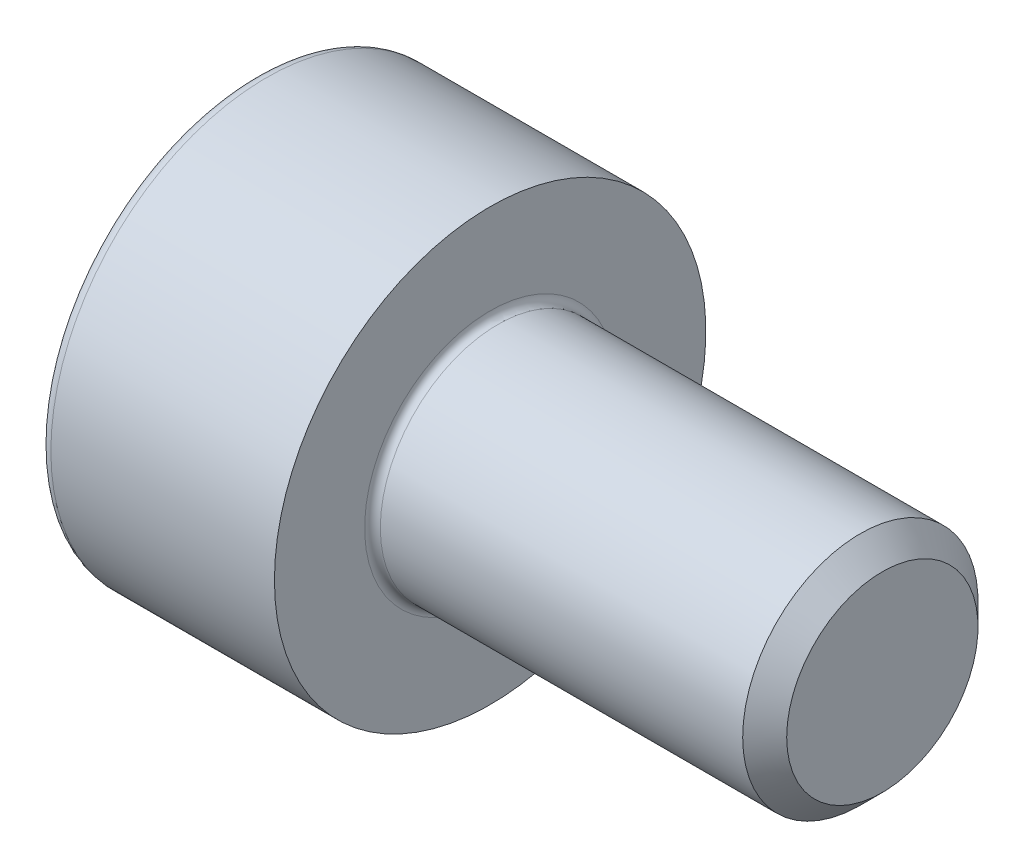
ISO-10303-21;
HEADER;
FILE_DESCRIPTION(('STEP AP214'),'2;1');
FILE_NAME('part.step','',(''),(''),'','','');
FILE_SCHEMA(('AUTOMOTIVE_DESIGN { 1 0 10303 214 1 1 1 1 }'));
ENDSEC;
DATA;
#1=APPLICATION_CONTEXT('core data for automotive mechanical design processes');
#2=APPLICATION_PROTOCOL_DEFINITION('international standard','automotive_design',2000,#1);
#3=PRODUCT_CONTEXT('',#1,'mechanical');
#4=PRODUCT('Part','Part','',(#3));
#5=PRODUCT_RELATED_PRODUCT_CATEGORY('part','',(#4));
#6=PRODUCT_DEFINITION_FORMATION('','',#4);
#7=PRODUCT_DEFINITION_CONTEXT('part definition',#1,'design');
#8=PRODUCT_DEFINITION('design','',#6,#7);
#9=PRODUCT_DEFINITION_SHAPE('','',#8);
#10=(LENGTH_UNIT() NAMED_UNIT(*) SI_UNIT(.MILLI.,.METRE.));
#11=(NAMED_UNIT(*) PLANE_ANGLE_UNIT() SI_UNIT($,.RADIAN.));
#12=(NAMED_UNIT(*) SI_UNIT($,.STERADIAN.) SOLID_ANGLE_UNIT());
#13=UNCERTAINTY_MEASURE_WITH_UNIT(LENGTH_MEASURE(1.E-05),#10,'distance_accuracy_value','');
#14=(GEOMETRIC_REPRESENTATION_CONTEXT(3) GLOBAL_UNCERTAINTY_ASSIGNED_CONTEXT((#13)) GLOBAL_UNIT_ASSIGNED_CONTEXT((#10,
#11,#12)) REPRESENTATION_CONTEXT('',''));
#15=CARTESIAN_POINT('',(0.,0.,0.));
#16=DIRECTION('',(0.,0.,1.));
#17=DIRECTION('',(1.,0.,0.));
#18=AXIS2_PLACEMENT_3D('',#15,#16,#17);
#19=CARTESIAN_POINT('',(0.,0.,0.));
#20=DIRECTION('',(-1.,0.,0.));
#21=DIRECTION('',(0.,0.,1.));
#22=AXIS2_PLACEMENT_3D('',#19,#20,#21);
#23=PLANE('',#22);
#24=DIRECTION('',(0.,-0.5,0.866025403784439));
#25=VECTOR('',#24,1.);
#26=CARTESIAN_POINT('',(0.,1.47801668912544,0.));
#27=LINE('',#26,#25);
#28=CARTESIAN_POINT('',(0.,1.47801668912544,0.));
#29=VERTEX_POINT('',#28);
#30=CARTESIAN_POINT('',(0.,0.73900834456272,1.28));
#31=VERTEX_POINT('',#30);
#32=EDGE_CURVE('E246',#29,#31,#27,.T.);
#33=ORIENTED_EDGE('',*,*,#32,.T.);
#34=DIRECTION('',(0.,1.,0.));
#35=VECTOR('',#34,1.);
#36=CARTESIAN_POINT('',(0.,-0.739008344562723,1.28));
#37=LINE('',#36,#35);
#38=CARTESIAN_POINT('',(0.,-0.739008344562723,1.28));
#39=VERTEX_POINT('',#38);
#40=EDGE_CURVE('E113',#39,#31,#37,.T.);
#41=ORIENTED_EDGE('',*,*,#40,.F.);
#42=DIRECTION('',(0.,-0.5,-0.866025403784438));
#43=VECTOR('',#42,1.);
#44=CARTESIAN_POINT('',(0.,-0.739008344562723,1.28));
#45=LINE('',#44,#43);
#46=CARTESIAN_POINT('',(0.,-1.47801668912545,0.));
#47=VERTEX_POINT('',#46);
#48=EDGE_CURVE('E249',#39,#47,#45,.T.);
#49=ORIENTED_EDGE('',*,*,#48,.T.);
#50=DIRECTION('',(0.,0.5,-0.866025403784439));
#51=VECTOR('',#50,1.);
#52=CARTESIAN_POINT('',(0.,-1.47801668912545,0.));
#53=LINE('',#52,#51);
#54=CARTESIAN_POINT('',(0.,-0.739008344562726,-1.28));
#55=VERTEX_POINT('',#54);
#56=EDGE_CURVE('E252',#47,#55,#53,.T.);
#57=ORIENTED_EDGE('',*,*,#56,.T.);
#58=DIRECTION('',(0.,-1.,0.));
#59=VECTOR('',#58,1.);
#60=CARTESIAN_POINT('',(0.,0.739008344562716,-1.28));
#61=LINE('',#60,#59);
#62=CARTESIAN_POINT('',(0.,0.739008344562716,-1.28));
#63=VERTEX_POINT('',#62);
#64=EDGE_CURVE('E255',#63,#55,#61,.T.);
#65=ORIENTED_EDGE('',*,*,#64,.F.);
#66=DIRECTION('',(0.,-0.5,-0.866025403784438));
#67=VECTOR('',#66,1.);
#68=CARTESIAN_POINT('',(0.,1.47801668912544,0.));
#69=LINE('',#68,#67);
#70=EDGE_CURVE('E108',#29,#63,#69,.T.);
#71=ORIENTED_EDGE('',*,*,#70,.F.);
#72=EDGE_LOOP('',(#33,#41,#49,#57,#65,#71));
#73=FACE_BOUND('',#72,.T.);
#74=CARTESIAN_POINT('',(0.,0.,0.));
#75=DIRECTION('',(-1.,0.,0.));
#76=DIRECTION('',(0.,0.,1.));
#77=AXIS2_PLACEMENT_3D('',#74,#75,#76);
#78=CIRCLE('',#77,2.6);
#79=CARTESIAN_POINT('',(0.,0.,2.6));
#80=VERTEX_POINT('',#79);
#81=EDGE_CURVE('E25',#80,#80,#78,.T.);
#82=ORIENTED_EDGE('',*,*,#81,.T.);
#83=EDGE_LOOP('',(#82));
#84=FACE_BOUND('',#83,.T.);
#85=ADVANCED_FACE('F17',(#73,#84),#23,.T.);
#86=CARTESIAN_POINT('',(-31.75,0.,0.));
#87=DIRECTION('',(-1.,0.,0.));
#88=DIRECTION('',(0.,0.,1.));
#89=AXIS2_PLACEMENT_3D('',#86,#87,#88);
#90=CYLINDRICAL_SURFACE('',#89,2.75);
#91=CARTESIAN_POINT('',(0.149999999999997,0.,0.));
#92=DIRECTION('',(-1.,0.,0.));
#93=DIRECTION('',(0.,0.,1.));
#94=AXIS2_PLACEMENT_3D('',#91,#92,#93);
#95=CIRCLE('',#94,2.75);
#96=CARTESIAN_POINT('',(0.149999999999997,0.,2.75));
#97=VERTEX_POINT('',#96);
#98=EDGE_CURVE('E11',#97,#97,#95,.F.);
#99=ORIENTED_EDGE('',*,*,#98,.T.);
#100=EDGE_LOOP('',(#99));
#101=FACE_BOUND('',#100,.T.);
#102=CARTESIAN_POINT('',(3.,0.,0.));
#103=DIRECTION('',(-1.,0.,0.));
#104=DIRECTION('',(0.,0.,1.));
#105=AXIS2_PLACEMENT_3D('',#102,#103,#104);
#106=CIRCLE('',#105,2.75);
#107=CARTESIAN_POINT('',(3.,0.,2.75));
#108=VERTEX_POINT('',#107);
#109=EDGE_CURVE('E131',#108,#108,#106,.T.);
#110=ORIENTED_EDGE('',*,*,#109,.T.);
#111=EDGE_LOOP('',(#110));
#112=FACE_BOUND('',#111,.T.);
#113=ADVANCED_FACE('F157',(#101,#112),#90,.T.);
#114=CARTESIAN_POINT('',(3.,2.75,0.));
#115=DIRECTION('',(1.,0.,0.));
#116=DIRECTION('',(0.,0.,-1.));
#117=AXIS2_PLACEMENT_3D('',#114,#115,#116);
#118=PLANE('',#117);
#119=CARTESIAN_POINT('',(3.,0.,0.));
#120=DIRECTION('',(1.,0.,0.));
#121=DIRECTION('',(0.,0.,-1.));
#122=AXIS2_PLACEMENT_3D('',#119,#120,#121);
#123=CIRCLE('',#122,1.6);
#124=CARTESIAN_POINT('',(3.,0.,-1.6));
#125=VERTEX_POINT('',#124);
#126=EDGE_CURVE('E134',#125,#125,#123,.F.);
#127=ORIENTED_EDGE('',*,*,#126,.T.);
#128=EDGE_LOOP('',(#127));
#129=FACE_BOUND('',#128,.T.);
#130=ORIENTED_EDGE('',*,*,#109,.F.);
#131=EDGE_LOOP('',(#130));
#132=FACE_BOUND('',#131,.T.);
#133=ADVANCED_FACE('F164',(#129,#132),#118,.T.);
#134=CARTESIAN_POINT('',(-31.75,0.,0.));
#135=DIRECTION('',(-1.,0.,0.));
#136=DIRECTION('',(0.,0.,1.));
#137=AXIS2_PLACEMENT_3D('',#134,#135,#136);
#138=CYLINDRICAL_SURFACE('',#137,1.5);
#139=CARTESIAN_POINT('',(3.1,0.,0.));
#140=DIRECTION('',(1.,0.,0.));
#141=DIRECTION('',(0.,0.,-1.));
#142=AXIS2_PLACEMENT_3D('',#139,#140,#141);
#143=CIRCLE('',#142,1.5);
#144=CARTESIAN_POINT('',(3.1,0.,-1.5));
#145=VERTEX_POINT('',#144);
#146=EDGE_CURVE('E137',#145,#145,#143,.T.);
#147=ORIENTED_EDGE('',*,*,#146,.T.);
#148=EDGE_LOOP('',(#147));
#149=FACE_BOUND('',#148,.T.);
#150=CARTESIAN_POINT('',(7.7195,0.,0.));
#151=DIRECTION('',(-1.,0.,0.));
#152=DIRECTION('',(0.,0.,1.));
#153=AXIS2_PLACEMENT_3D('',#150,#151,#152);
#154=CIRCLE('',#153,1.5);
#155=CARTESIAN_POINT('',(7.7195,0.,1.5));
#156=VERTEX_POINT('',#155);
#157=EDGE_CURVE('E128',#156,#156,#154,.T.);
#158=ORIENTED_EDGE('',*,*,#157,.T.);
#159=EDGE_LOOP('',(#158));
#160=FACE_BOUND('',#159,.T.);
#161=ADVANCED_FACE('F170',(#149,#160),#138,.T.);
#162=CARTESIAN_POINT('',(8.,0.,0.));
#163=DIRECTION('',(-1.,0.,0.));
#164=DIRECTION('',(0.,0.,1.));
#165=AXIS2_PLACEMENT_3D('',#162,#163,#164);
#166=CONICAL_SURFACE('',#165,1.2195,0.78539816339747);
#167=ORIENTED_EDGE('',*,*,#157,.F.);
#168=EDGE_LOOP('',(#167));
#169=FACE_BOUND('',#168,.T.);
#170=CARTESIAN_POINT('',(8.,0.,0.));
#171=DIRECTION('',(-1.,0.,0.));
#172=DIRECTION('',(0.,0.,1.));
#173=AXIS2_PLACEMENT_3D('',#170,#171,#172);
#174=CIRCLE('',#173,1.2195);
#175=CARTESIAN_POINT('',(8.,0.,1.2195));
#176=VERTEX_POINT('',#175);
#177=EDGE_CURVE('E124',#176,#176,#174,.T.);
#178=ORIENTED_EDGE('',*,*,#177,.T.);
#179=EDGE_LOOP('',(#178));
#180=FACE_BOUND('',#179,.T.);
#181=ADVANCED_FACE('F174',(#169,#180),#166,.T.);
#182=CARTESIAN_POINT('',(8.,1.2195,0.));
#183=DIRECTION('',(1.,0.,0.));
#184=DIRECTION('',(0.,0.,-1.));
#185=AXIS2_PLACEMENT_3D('',#182,#183,#184);
#186=PLANE('',#185);
#187=ORIENTED_EDGE('',*,*,#177,.F.);
#188=EDGE_LOOP('',(#187));
#189=FACE_BOUND('',#188,.T.);
#190=ADVANCED_FACE('F153',(#189),#186,.T.);
#191=CARTESIAN_POINT('',(3.1,0.,0.));
#192=DIRECTION('',(1.,0.,0.));
#193=DIRECTION('',(0.,0.,-1.));
#194=AXIS2_PLACEMENT_3D('',#191,#192,#193);
#195=TOROIDAL_SURFACE('',#194,1.6,0.1);
#196=ORIENTED_EDGE('',*,*,#146,.F.);
#197=EDGE_LOOP('',(#196));
#198=FACE_BOUND('',#197,.T.);
#199=ORIENTED_EDGE('',*,*,#126,.F.);
#200=EDGE_LOOP('',(#199));
#201=FACE_BOUND('',#200,.T.);
#202=ADVANCED_FACE('F144',(#198,#201),#195,.F.);
#203=CARTESIAN_POINT('',(0.149999999999997,0.,0.));
#204=DIRECTION('',(-1.,0.,0.));
#205=DIRECTION('',(0.,0.,1.));
#206=AXIS2_PLACEMENT_3D('',#203,#204,#205);
#207=TOROIDAL_SURFACE('',#206,2.6,0.15);
#208=ORIENTED_EDGE('',*,*,#98,.F.);
#209=EDGE_LOOP('',(#208));
#210=FACE_BOUND('',#209,.T.);
#211=ORIENTED_EDGE('',*,*,#81,.F.);
#212=EDGE_LOOP('',(#211));
#213=FACE_BOUND('',#212,.T.);
#214=ADVANCED_FACE('F19',(#210,#213),#207,.T.);
#215=CARTESIAN_POINT('',(1.3,1.47801668912544,0.));
#216=DIRECTION('',(0.,-0.866025403784439,-0.5));
#217=DIRECTION('',(0.,0.5,-0.866025403784439));
#218=AXIS2_PLACEMENT_3D('',#215,#216,#217);
#219=PLANE('',#218);
#220=ORIENTED_EDGE('',*,*,#32,.F.);
#221=DIRECTION('',(-1.,0.,0.));
#222=VECTOR('',#221,1.);
#223=CARTESIAN_POINT('',(1.3,1.47801668912544,0.));
#224=LINE('',#223,#222);
#225=CARTESIAN_POINT('',(1.3,1.47801668912544,0.));
#226=VERTEX_POINT('',#225);
#227=EDGE_CURVE('E236',#226,#29,#224,.T.);
#228=ORIENTED_EDGE('',*,*,#227,.F.);
#229=DIRECTION('',(0.,-0.5,0.866025403784439));
#230=VECTOR('',#229,1.);
#231=CARTESIAN_POINT('',(1.3,1.47801668912544,0.));
#232=LINE('',#231,#230);
#233=CARTESIAN_POINT('',(1.3,1.10851251684408,0.64));
#234=VERTEX_POINT('',#233);
#235=EDGE_CURVE('E100',#226,#234,#232,.T.);
#236=ORIENTED_EDGE('',*,*,#235,.T.);
#237=CARTESIAN_POINT('',(1.3,0.73900834456272,1.28));
#238=VERTEX_POINT('',#237);
#239=EDGE_CURVE('E91',#234,#238,#232,.T.);
#240=ORIENTED_EDGE('',*,*,#239,.T.);
#241=DIRECTION('',(-1.,0.,0.));
#242=VECTOR('',#241,1.);
#243=CARTESIAN_POINT('',(1.3,0.73900834456272,1.28));
#244=LINE('',#243,#242);
#245=EDGE_CURVE('E105',#238,#31,#244,.T.);
#246=ORIENTED_EDGE('',*,*,#245,.T.);
#247=EDGE_LOOP('',(#220,#228,#236,#240,#246));
#248=FACE_BOUND('',#247,.T.);
#249=ADVANCED_FACE('F104',(#248),#219,.T.);
#250=CARTESIAN_POINT('',(1.3,-0.739008344562723,1.28));
#251=DIRECTION('',(0.,0.,1.));
#252=DIRECTION('',(0.,-1.,0.));
#253=AXIS2_PLACEMENT_3D('',#250,#251,#252);
#254=PLANE('',#253);
#255=ORIENTED_EDGE('',*,*,#40,.T.);
#256=ORIENTED_EDGE('',*,*,#245,.F.);
#257=DIRECTION('',(0.,1.,0.));
#258=VECTOR('',#257,1.);
#259=CARTESIAN_POINT('',(1.3,-0.739008344562723,1.28));
#260=LINE('',#259,#258);
#261=CARTESIAN_POINT('',(1.3,0.,1.28));
#262=VERTEX_POINT('',#261);
#263=EDGE_CURVE('E88',#262,#238,#260,.T.);
#264=ORIENTED_EDGE('',*,*,#263,.F.);
#265=CARTESIAN_POINT('',(1.3,-0.739008344562723,1.28));
#266=VERTEX_POINT('',#265);
#267=EDGE_CURVE('E99',#266,#262,#260,.T.);
#268=ORIENTED_EDGE('',*,*,#267,.F.);
#269=DIRECTION('',(-1.,0.,0.));
#270=VECTOR('',#269,1.);
#271=CARTESIAN_POINT('',(1.3,-0.739008344562723,1.28));
#272=LINE('',#271,#270);
#273=EDGE_CURVE('E115',#266,#39,#272,.T.);
#274=ORIENTED_EDGE('',*,*,#273,.T.);
#275=EDGE_LOOP('',(#255,#256,#264,#268,#274));
#276=FACE_BOUND('',#275,.T.);
#277=ADVANCED_FACE('F110',(#276),#254,.F.);
#278=CARTESIAN_POINT('',(1.3,-0.739008344562723,1.28));
#279=DIRECTION('',(0.,0.866025403784438,-0.5));
#280=DIRECTION('',(0.,0.5,0.866025403784438));
#281=AXIS2_PLACEMENT_3D('',#278,#279,#280);
#282=PLANE('',#281);
#283=ORIENTED_EDGE('',*,*,#48,.F.);
#284=ORIENTED_EDGE('',*,*,#273,.F.);
#285=DIRECTION('',(0.,-0.5,-0.866025403784438));
#286=VECTOR('',#285,1.);
#287=CARTESIAN_POINT('',(1.3,-0.739008344562723,1.28));
#288=LINE('',#287,#286);
#289=CARTESIAN_POINT('',(1.3,-1.10851251684408,0.64));
#290=VERTEX_POINT('',#289);
#291=EDGE_CURVE('E275',#266,#290,#288,.T.);
#292=ORIENTED_EDGE('',*,*,#291,.T.);
#293=CARTESIAN_POINT('',(1.3,-1.47801668912545,0.));
#294=VERTEX_POINT('',#293);
#295=EDGE_CURVE('E264',#290,#294,#288,.T.);
#296=ORIENTED_EDGE('',*,*,#295,.T.);
#297=DIRECTION('',(-1.,0.,0.));
#298=VECTOR('',#297,1.);
#299=CARTESIAN_POINT('',(1.3,-1.47801668912545,0.));
#300=LINE('',#299,#298);
#301=EDGE_CURVE('E120',#294,#47,#300,.T.);
#302=ORIENTED_EDGE('',*,*,#301,.T.);
#303=EDGE_LOOP('',(#283,#284,#292,#296,#302));
#304=FACE_BOUND('',#303,.T.);
#305=ADVANCED_FACE('F188',(#304),#282,.T.);
#306=CARTESIAN_POINT('',(1.3,-1.47801668912545,0.));
#307=DIRECTION('',(0.,0.866025403784439,0.5));
#308=DIRECTION('',(0.,-0.5,0.866025403784439));
#309=AXIS2_PLACEMENT_3D('',#306,#307,#308);
#310=PLANE('',#309);
#311=ORIENTED_EDGE('',*,*,#56,.F.);
#312=ORIENTED_EDGE('',*,*,#301,.F.);
#313=DIRECTION('',(0.,0.5,-0.866025403784439));
#314=VECTOR('',#313,1.);
#315=CARTESIAN_POINT('',(1.3,-1.47801668912545,0.));
#316=LINE('',#315,#314);
#317=CARTESIAN_POINT('',(1.3,-1.10851251684409,-0.64));
#318=VERTEX_POINT('',#317);
#319=EDGE_CURVE('E242',#294,#318,#316,.T.);
#320=ORIENTED_EDGE('',*,*,#319,.T.);
#321=CARTESIAN_POINT('',(1.3,-0.739008344562726,-1.28));
#322=VERTEX_POINT('',#321);
#323=EDGE_CURVE('E274',#318,#322,#316,.T.);
#324=ORIENTED_EDGE('',*,*,#323,.T.);
#325=DIRECTION('',(-1.,0.,0.));
#326=VECTOR('',#325,1.);
#327=CARTESIAN_POINT('',(1.3,-0.739008344562726,-1.28));
#328=LINE('',#327,#326);
#329=EDGE_CURVE('E235',#322,#55,#328,.T.);
#330=ORIENTED_EDGE('',*,*,#329,.T.);
#331=EDGE_LOOP('',(#311,#312,#320,#324,#330));
#332=FACE_BOUND('',#331,.T.);
#333=ADVANCED_FACE('F191',(#332),#310,.T.);
#334=CARTESIAN_POINT('',(1.3,0.739008344562716,-1.28));
#335=DIRECTION('',(0.,0.,-1.));
#336=DIRECTION('',(0.,1.,0.));
#337=AXIS2_PLACEMENT_3D('',#334,#335,#336);
#338=PLANE('',#337);
#339=ORIENTED_EDGE('',*,*,#64,.T.);
#340=ORIENTED_EDGE('',*,*,#329,.F.);
#341=DIRECTION('',(0.,-1.,0.));
#342=VECTOR('',#341,1.);
#343=CARTESIAN_POINT('',(1.3,0.739008344562716,-1.28));
#344=LINE('',#343,#342);
#345=CARTESIAN_POINT('',(1.3,0.,-1.28));
#346=VERTEX_POINT('',#345);
#347=EDGE_CURVE('E239',#346,#322,#344,.T.);
#348=ORIENTED_EDGE('',*,*,#347,.F.);
#349=CARTESIAN_POINT('',(1.3,0.739008344562716,-1.28));
#350=VERTEX_POINT('',#349);
#351=EDGE_CURVE('E32',#350,#346,#344,.T.);
#352=ORIENTED_EDGE('',*,*,#351,.F.);
#353=DIRECTION('',(-1.,0.,0.));
#354=VECTOR('',#353,1.);
#355=CARTESIAN_POINT('',(1.3,0.739008344562716,-1.28));
#356=LINE('',#355,#354);
#357=EDGE_CURVE('E232',#350,#63,#356,.T.);
#358=ORIENTED_EDGE('',*,*,#357,.T.);
#359=EDGE_LOOP('',(#339,#340,#348,#352,#358));
#360=FACE_BOUND('',#359,.T.);
#361=ADVANCED_FACE('F195',(#360),#338,.F.);
#362=CARTESIAN_POINT('',(1.3,1.47801668912544,0.));
#363=DIRECTION('',(0.,0.866025403784438,-0.5));
#364=DIRECTION('',(0.,0.5,0.866025403784438));
#365=AXIS2_PLACEMENT_3D('',#362,#363,#364);
#366=PLANE('',#365);
#367=ORIENTED_EDGE('',*,*,#70,.T.);
#368=ORIENTED_EDGE('',*,*,#357,.F.);
#369=DIRECTION('',(0.,-0.5,-0.866025403784438));
#370=VECTOR('',#369,1.);
#371=CARTESIAN_POINT('',(1.3,1.47801668912544,0.));
#372=LINE('',#371,#370);
#373=CARTESIAN_POINT('',(1.3,1.10851251684408,-0.64));
#374=VERTEX_POINT('',#373);
#375=EDGE_CURVE('E222',#374,#350,#372,.T.);
#376=ORIENTED_EDGE('',*,*,#375,.F.);
#377=EDGE_CURVE('E228',#226,#374,#372,.T.);
#378=ORIENTED_EDGE('',*,*,#377,.F.);
#379=ORIENTED_EDGE('',*,*,#227,.T.);
#380=EDGE_LOOP('',(#367,#368,#376,#378,#379));
#381=FACE_BOUND('',#380,.T.);
#382=ADVANCED_FACE('F199',(#381),#366,.F.);
#383=CARTESIAN_POINT('',(1.3,1.47801668912544,0.));
#384=DIRECTION('',(1.,0.,0.));
#385=DIRECTION('',(0.,0.,-1.));
#386=AXIS2_PLACEMENT_3D('',#383,#384,#385);
#387=PLANE('',#386);
#388=ORIENTED_EDGE('',*,*,#347,.T.);
#389=ORIENTED_EDGE('',*,*,#323,.F.);
#390=CARTESIAN_POINT('',(1.3,0.,0.));
#391=DIRECTION('',(-1.,0.,0.));
#392=DIRECTION('',(0.,0.,1.));
#393=AXIS2_PLACEMENT_3D('',#390,#391,#392);
#394=CIRCLE('',#393,1.28);
#395=EDGE_CURVE('E270',#346,#318,#394,.T.);
#396=ORIENTED_EDGE('',*,*,#395,.F.);
#397=EDGE_LOOP('',(#388,#389,#396));
#398=FACE_BOUND('',#397,.T.);
#399=ADVANCED_FACE('F203',(#398),#387,.F.);
#400=ORIENTED_EDGE('',*,*,#319,.F.);
#401=ORIENTED_EDGE('',*,*,#295,.F.);
#402=EDGE_CURVE('E118',#318,#290,#394,.T.);
#403=ORIENTED_EDGE('',*,*,#402,.F.);
#404=EDGE_LOOP('',(#400,#401,#403));
#405=FACE_BOUND('',#404,.T.);
#406=ADVANCED_FACE('F206',(#405),#387,.F.);
#407=ORIENTED_EDGE('',*,*,#291,.F.);
#408=ORIENTED_EDGE('',*,*,#267,.T.);
#409=EDGE_CURVE('E114',#290,#262,#394,.T.);
#410=ORIENTED_EDGE('',*,*,#409,.F.);
#411=EDGE_LOOP('',(#407,#408,#410));
#412=FACE_BOUND('',#411,.T.);
#413=ADVANCED_FACE('F212',(#412),#387,.F.);
#414=ORIENTED_EDGE('',*,*,#263,.T.);
#415=ORIENTED_EDGE('',*,*,#239,.F.);
#416=EDGE_CURVE('E94',#262,#234,#394,.T.);
#417=ORIENTED_EDGE('',*,*,#416,.F.);
#418=EDGE_LOOP('',(#414,#415,#417));
#419=FACE_BOUND('',#418,.T.);
#420=ADVANCED_FACE('F90',(#419),#387,.F.);
#421=ORIENTED_EDGE('',*,*,#235,.F.);
#422=ORIENTED_EDGE('',*,*,#377,.T.);
#423=EDGE_CURVE('E125',#234,#374,#394,.T.);
#424=ORIENTED_EDGE('',*,*,#423,.F.);
#425=EDGE_LOOP('',(#421,#422,#424));
#426=FACE_BOUND('',#425,.T.);
#427=ADVANCED_FACE('F215',(#426),#387,.F.);
#428=ORIENTED_EDGE('',*,*,#375,.T.);
#429=ORIENTED_EDGE('',*,*,#351,.T.);
#430=EDGE_CURVE('E225',#374,#346,#394,.T.);
#431=ORIENTED_EDGE('',*,*,#430,.F.);
#432=EDGE_LOOP('',(#428,#429,#431));
#433=FACE_BOUND('',#432,.T.);
#434=ADVANCED_FACE('F184',(#433),#387,.F.);
#435=CARTESIAN_POINT('',(1.3,0.,0.));
#436=DIRECTION('',(-1.,0.,0.));
#437=DIRECTION('',(0.,0.,1.));
#438=AXIS2_PLACEMENT_3D('',#435,#436,#437);
#439=CONICAL_SURFACE('',#438,1.28,1.0471975511966);
#440=CARTESIAN_POINT('',(2.03900834456273,0.,0.));
#441=VERTEX_POINT('',#440);
#442=VERTEX_LOOP('',#441);
#443=FACE_BOUND('',#442,.T.);
#444=ORIENTED_EDGE('',*,*,#416,.T.);
#445=ORIENTED_EDGE('',*,*,#423,.T.);
#446=ORIENTED_EDGE('',*,*,#430,.T.);
#447=ORIENTED_EDGE('',*,*,#395,.T.);
#448=ORIENTED_EDGE('',*,*,#402,.T.);
#449=ORIENTED_EDGE('',*,*,#409,.T.);
#450=EDGE_LOOP('',(#444,#445,#446,#447,#448,#449));
#451=FACE_BOUND('',#450,.T.);
#452=ADVANCED_FACE('F182',(#443,#451),#439,.F.);
#453=CLOSED_SHELL('',(#85,#113,#133,#161,#181,#190,#202,#214,#249,#277,#305,#333,#361,#382,#399,
#406,#413,#420,#427,#434,#452));
#454=MANIFOLD_SOLID_BREP('B1',#453);
#455=ADVANCED_BREP_SHAPE_REPRESENTATION('',(#18,#454),#14);
#456=SHAPE_DEFINITION_REPRESENTATION(#9,#455);
ENDSEC;
END-ISO-10303-21;
